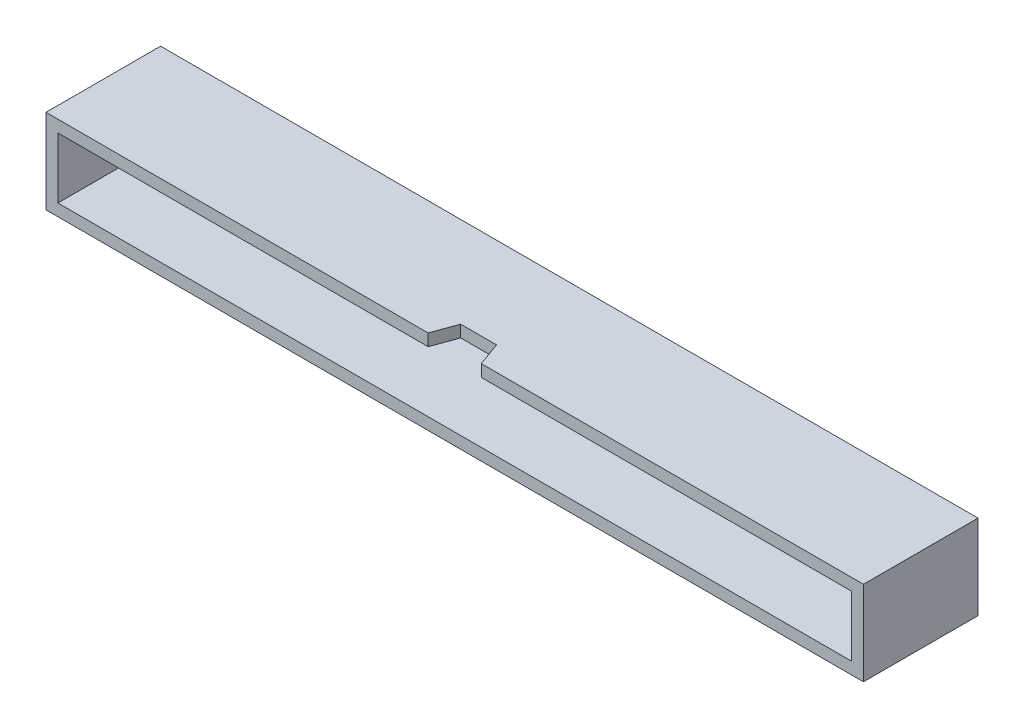
ISO-10303-21;
HEADER;
FILE_DESCRIPTION(('STEP AP214'),'2;1');
FILE_NAME('part.step','',(''),(''),'','','');
FILE_SCHEMA(('AUTOMOTIVE_DESIGN { 1 0 10303 214 1 1 1 1 }'));
ENDSEC;
DATA;
#1=APPLICATION_CONTEXT('core data for automotive mechanical design processes');
#2=APPLICATION_PROTOCOL_DEFINITION('international standard','automotive_design',2000,#1);
#3=PRODUCT_CONTEXT('',#1,'mechanical');
#4=PRODUCT('Part','Part','',(#3));
#5=PRODUCT_RELATED_PRODUCT_CATEGORY('part','',(#4));
#6=PRODUCT_DEFINITION_FORMATION('','',#4);
#7=PRODUCT_DEFINITION_CONTEXT('part definition',#1,'design');
#8=PRODUCT_DEFINITION('design','',#6,#7);
#9=PRODUCT_DEFINITION_SHAPE('','',#8);
#10=(LENGTH_UNIT() NAMED_UNIT(*) SI_UNIT(.MILLI.,.METRE.));
#11=(NAMED_UNIT(*) PLANE_ANGLE_UNIT() SI_UNIT($,.RADIAN.));
#12=(NAMED_UNIT(*) SI_UNIT($,.STERADIAN.) SOLID_ANGLE_UNIT());
#13=UNCERTAINTY_MEASURE_WITH_UNIT(LENGTH_MEASURE(1.E-05),#10,'distance_accuracy_value','');
#14=(GEOMETRIC_REPRESENTATION_CONTEXT(3) GLOBAL_UNCERTAINTY_ASSIGNED_CONTEXT((#13)) GLOBAL_UNIT_ASSIGNED_CONTEXT((#10,
#11,#12)) REPRESENTATION_CONTEXT('',''));
#15=CARTESIAN_POINT('',(0.,0.,0.));
#16=DIRECTION('',(0.,0.,1.));
#17=DIRECTION('',(1.,0.,0.));
#18=AXIS2_PLACEMENT_3D('',#15,#16,#17);
#19=CARTESIAN_POINT('',(33.48,3.54,7.60000000000002));
#20=DIRECTION('',(0.939692620785973,0.,-0.34202014332549));
#21=DIRECTION('',(-0.34202014332549,0.,-0.939692620785973));
#22=AXIS2_PLACEMENT_3D('',#19,#20,#21);
#23=PLANE('',#22);
#24=DIRECTION('',(0.,1.,0.));
#25=VECTOR('',#24,1.);
#26=CARTESIAN_POINT('',(34.207940468532,3.54,9.60000000000001));
#27=LINE('',#26,#25);
#28=CARTESIAN_POINT('',(34.207940468532,3.54,9.6));
#29=VERTEX_POINT('',#28);
#30=CARTESIAN_POINT('',(34.207940468532,2.53999998509884,9.6));
#31=VERTEX_POINT('',#30);
#32=EDGE_CURVE('E20',#29,#31,#27,.F.);
#33=ORIENTED_EDGE('',*,*,#32,.F.);
#34=DIRECTION('',(0.342020143325502,0.,0.939692620785969));
#35=VECTOR('',#34,1.);
#36=CARTESIAN_POINT('',(33.48,3.54,7.60000000000002));
#37=LINE('',#36,#35);
#38=CARTESIAN_POINT('',(33.48,3.54,7.60000000000002));
#39=VERTEX_POINT('',#38);
#40=EDGE_CURVE('E114',#39,#29,#37,.T.);
#41=ORIENTED_EDGE('',*,*,#40,.F.);
#42=DIRECTION('',(0.,1.,0.));
#43=VECTOR('',#42,1.);
#44=CARTESIAN_POINT('',(33.48,3.54,7.60000000000001));
#45=LINE('',#44,#43);
#46=CARTESIAN_POINT('',(33.48,2.53999998509884,7.60000000000002));
#47=VERTEX_POINT('',#46);
#48=EDGE_CURVE('E109',#39,#47,#45,.F.);
#49=ORIENTED_EDGE('',*,*,#48,.T.);
#50=DIRECTION('',(-0.342020143325502,0.,-0.939692620785969));
#51=VECTOR('',#50,1.);
#52=CARTESIAN_POINT('',(34.207940468532,2.53999998509884,9.6));
#53=LINE('',#52,#51);
#54=EDGE_CURVE('E111',#31,#47,#53,.T.);
#55=ORIENTED_EDGE('',*,*,#54,.F.);
#56=EDGE_LOOP('',(#33,#41,#49,#55));
#57=FACE_BOUND('',#56,.T.);
#58=ADVANCED_FACE('F17',(#57),#23,.F.);
#59=CARTESIAN_POINT('',(29.7520595314676,3.54,9.6));
#60=DIRECTION('',(-0.939692620785908,0.,-0.342020143325669));
#61=DIRECTION('',(-0.342020143325669,0.,0.939692620785908));
#62=AXIS2_PLACEMENT_3D('',#59,#60,#61);
#63=PLANE('',#62);
#64=DIRECTION('',(0.,1.,0.));
#65=VECTOR('',#64,1.);
#66=CARTESIAN_POINT('',(30.48,3.54,7.60000000000001));
#67=LINE('',#66,#65);
#68=CARTESIAN_POINT('',(30.48,2.53999998509884,7.60000000000001));
#69=VERTEX_POINT('',#68);
#70=CARTESIAN_POINT('',(30.48,3.54,7.60000000000001));
#71=VERTEX_POINT('',#70);
#72=EDGE_CURVE('E103',#69,#71,#67,.T.);
#73=ORIENTED_EDGE('',*,*,#72,.T.);
#74=DIRECTION('',(0.342020143325667,0.,-0.939692620785909));
#75=VECTOR('',#74,1.);
#76=CARTESIAN_POINT('',(29.7520595314676,3.54,9.6));
#77=LINE('',#76,#75);
#78=CARTESIAN_POINT('',(29.7520595314676,3.54,9.6));
#79=VERTEX_POINT('',#78);
#80=EDGE_CURVE('E150',#79,#71,#77,.T.);
#81=ORIENTED_EDGE('',*,*,#80,.F.);
#82=DIRECTION('',(0.,1.,0.));
#83=VECTOR('',#82,1.);
#84=CARTESIAN_POINT('',(29.7520595314676,3.54,9.6));
#85=LINE('',#84,#83);
#86=CARTESIAN_POINT('',(29.7520595314676,2.53999998509884,9.6));
#87=VERTEX_POINT('',#86);
#88=EDGE_CURVE('E136',#87,#79,#85,.T.);
#89=ORIENTED_EDGE('',*,*,#88,.F.);
#90=DIRECTION('',(-0.342020143325667,0.,0.939692620785909));
#91=VECTOR('',#90,1.);
#92=CARTESIAN_POINT('',(30.48,2.53999998509884,7.60000000000001));
#93=LINE('',#92,#91);
#94=EDGE_CURVE('E123',#69,#87,#93,.T.);
#95=ORIENTED_EDGE('',*,*,#94,.F.);
#96=EDGE_LOOP('',(#73,#81,#89,#95));
#97=FACE_BOUND('',#96,.T.);
#98=ADVANCED_FACE('F253',(#97),#63,.F.);
#99=CARTESIAN_POINT('',(30.48,3.54,7.60000000000001));
#100=DIRECTION('',(0.,0.,-1.));
#101=DIRECTION('',(-1.,0.,0.));
#102=AXIS2_PLACEMENT_3D('',#99,#100,#101);
#103=PLANE('',#102);
#104=ORIENTED_EDGE('',*,*,#48,.F.);
#105=DIRECTION('',(1.,0.,0.));
#106=VECTOR('',#105,1.);
#107=CARTESIAN_POINT('',(66.23,3.54,7.60000000000001));
#108=LINE('',#107,#106);
#109=EDGE_CURVE('E149',#71,#39,#108,.T.);
#110=ORIENTED_EDGE('',*,*,#109,.F.);
#111=ORIENTED_EDGE('',*,*,#72,.F.);
#112=DIRECTION('',(1.,0.,0.));
#113=VECTOR('',#112,1.);
#114=CARTESIAN_POINT('',(-1.26999998509884,2.53999998509884,7.60000000000002));
#115=LINE('',#114,#113);
#116=EDGE_CURVE('E119',#47,#69,#115,.F.);
#117=ORIENTED_EDGE('',*,*,#116,.F.);
#118=EDGE_LOOP('',(#104,#110,#111,#117));
#119=FACE_BOUND('',#118,.T.);
#120=ADVANCED_FACE('F120',(#119),#103,.F.);
#121=CARTESIAN_POINT('',(65.2299999850988,2.53999998509884,0.));
#122=DIRECTION('',(-1.,0.,0.));
#123=DIRECTION('',(0.,0.,1.));
#124=AXIS2_PLACEMENT_3D('',#121,#122,#123);
#125=PLANE('',#124);
#126=DIRECTION('',(0.,1.,0.));
#127=VECTOR('',#126,1.);
#128=CARTESIAN_POINT('',(65.2299999850988,0.,9.6));
#129=LINE('',#128,#127);
#130=CARTESIAN_POINT('',(65.2299999850988,2.53999998509884,9.6));
#131=VERTEX_POINT('',#130);
#132=CARTESIAN_POINT('',(65.2299999850988,-2.53999998509884,9.6));
#133=VERTEX_POINT('',#132);
#134=EDGE_CURVE('E175',#131,#133,#129,.F.);
#135=ORIENTED_EDGE('',*,*,#134,.F.);
#136=DIRECTION('',(0.,0.,-1.));
#137=VECTOR('',#136,1.);
#138=CARTESIAN_POINT('',(65.2299999850988,2.53999998509884,0.));
#139=LINE('',#138,#137);
#140=CARTESIAN_POINT('',(65.2299999850988,2.53999998509884,0.));
#141=VERTEX_POINT('',#140);
#142=EDGE_CURVE('E151',#141,#131,#139,.F.);
#143=ORIENTED_EDGE('',*,*,#142,.F.);
#144=DIRECTION('',(0.,1.,0.));
#145=VECTOR('',#144,1.);
#146=CARTESIAN_POINT('',(65.2299999850988,0.,0.));
#147=LINE('',#146,#145);
#148=CARTESIAN_POINT('',(65.2299999850988,-2.53999998509884,0.));
#149=VERTEX_POINT('',#148);
#150=EDGE_CURVE('E190',#141,#149,#147,.F.);
#151=ORIENTED_EDGE('',*,*,#150,.T.);
#152=DIRECTION('',(0.,0.,1.));
#153=VECTOR('',#152,1.);
#154=CARTESIAN_POINT('',(65.2299999850988,-2.53999998509884,0.));
#155=LINE('',#154,#153);
#156=EDGE_CURVE('E116',#133,#149,#155,.F.);
#157=ORIENTED_EDGE('',*,*,#156,.F.);
#158=EDGE_LOOP('',(#135,#143,#151,#157));
#159=FACE_BOUND('',#158,.T.);
#160=ADVANCED_FACE('F247',(#159),#125,.T.);
#161=CARTESIAN_POINT('',(65.2299999850988,-2.53999998509884,0.));
#162=DIRECTION('',(0.,1.,0.));
#163=DIRECTION('',(0.,0.,1.));
#164=AXIS2_PLACEMENT_3D('',#161,#162,#163);
#165=PLANE('',#164);
#166=DIRECTION('',(1.,0.,0.));
#167=VECTOR('',#166,1.);
#168=CARTESIAN_POINT('',(31.98,-2.53999998509884,9.6));
#169=LINE('',#168,#167);
#170=CARTESIAN_POINT('',(-1.26999998509884,-2.53999998509884,9.6));
#171=VERTEX_POINT('',#170);
#172=EDGE_CURVE('E170',#133,#171,#169,.F.);
#173=ORIENTED_EDGE('',*,*,#172,.F.);
#174=ORIENTED_EDGE('',*,*,#156,.T.);
#175=DIRECTION('',(1.,0.,0.));
#176=VECTOR('',#175,1.);
#177=CARTESIAN_POINT('',(31.98,-2.53999998509884,0.));
#178=LINE('',#177,#176);
#179=CARTESIAN_POINT('',(-1.26999998509884,-2.53999998509884,0.));
#180=VERTEX_POINT('',#179);
#181=EDGE_CURVE('E188',#149,#180,#178,.F.);
#182=ORIENTED_EDGE('',*,*,#181,.T.);
#183=DIRECTION('',(0.,0.,1.));
#184=VECTOR('',#183,1.);
#185=CARTESIAN_POINT('',(-1.26999998509884,-2.53999998509884,0.));
#186=LINE('',#185,#184);
#187=EDGE_CURVE('E128',#171,#180,#186,.F.);
#188=ORIENTED_EDGE('',*,*,#187,.F.);
#189=EDGE_LOOP('',(#173,#174,#182,#188));
#190=FACE_BOUND('',#189,.T.);
#191=ADVANCED_FACE('F243',(#190),#165,.T.);
#192=CARTESIAN_POINT('',(-1.26999998509884,-2.53999998509884,0.));
#193=DIRECTION('',(1.,0.,0.));
#194=DIRECTION('',(0.,1.,0.));
#195=AXIS2_PLACEMENT_3D('',#192,#193,#194);
#196=PLANE('',#195);
#197=DIRECTION('',(0.,1.,0.));
#198=VECTOR('',#197,1.);
#199=CARTESIAN_POINT('',(-1.26999998509884,0.,9.6));
#200=LINE('',#199,#198);
#201=CARTESIAN_POINT('',(-1.26999998509884,2.53999998509884,9.6));
#202=VERTEX_POINT('',#201);
#203=EDGE_CURVE('E165',#171,#202,#200,.T.);
#204=ORIENTED_EDGE('',*,*,#203,.F.);
#205=ORIENTED_EDGE('',*,*,#187,.T.);
#206=DIRECTION('',(0.,1.,0.));
#207=VECTOR('',#206,1.);
#208=CARTESIAN_POINT('',(-1.26999998509884,0.,0.));
#209=LINE('',#208,#207);
#210=CARTESIAN_POINT('',(-1.26999998509884,2.53999998509884,0.));
#211=VERTEX_POINT('',#210);
#212=EDGE_CURVE('E186',#180,#211,#209,.T.);
#213=ORIENTED_EDGE('',*,*,#212,.T.);
#214=DIRECTION('',(0.,0.,-1.));
#215=VECTOR('',#214,1.);
#216=CARTESIAN_POINT('',(-1.26999998509884,2.53999998509884,0.));
#217=LINE('',#216,#215);
#218=EDGE_CURVE('E154',#202,#211,#217,.T.);
#219=ORIENTED_EDGE('',*,*,#218,.F.);
#220=EDGE_LOOP('',(#204,#205,#213,#219));
#221=FACE_BOUND('',#220,.T.);
#222=ADVANCED_FACE('F240',(#221),#196,.T.);
#223=CARTESIAN_POINT('',(-1.26999998509884,2.53999998509884,0.));
#224=DIRECTION('',(0.,-1.,0.));
#225=DIRECTION('',(0.,0.,-1.));
#226=AXIS2_PLACEMENT_3D('',#223,#224,#225);
#227=PLANE('',#226);
#228=ORIENTED_EDGE('',*,*,#142,.T.);
#229=DIRECTION('',(1.,0.,0.));
#230=VECTOR('',#229,1.);
#231=CARTESIAN_POINT('',(31.98,2.53999998509884,9.6));
#232=LINE('',#231,#230);
#233=EDGE_CURVE('E127',#31,#131,#232,.T.);
#234=ORIENTED_EDGE('',*,*,#233,.F.);
#235=ORIENTED_EDGE('',*,*,#54,.T.);
#236=ORIENTED_EDGE('',*,*,#116,.T.);
#237=ORIENTED_EDGE('',*,*,#94,.T.);
#238=DIRECTION('',(1.,0.,0.));
#239=VECTOR('',#238,1.);
#240=CARTESIAN_POINT('',(31.98,2.53999998509884,9.6));
#241=LINE('',#240,#239);
#242=EDGE_CURVE('E160',#202,#87,#241,.T.);
#243=ORIENTED_EDGE('',*,*,#242,.F.);
#244=ORIENTED_EDGE('',*,*,#218,.T.);
#245=DIRECTION('',(1.,0.,0.));
#246=VECTOR('',#245,1.);
#247=CARTESIAN_POINT('',(31.98,2.53999998509884,0.));
#248=LINE('',#247,#246);
#249=EDGE_CURVE('E183',#211,#141,#248,.T.);
#250=ORIENTED_EDGE('',*,*,#249,.T.);
#251=EDGE_LOOP('',(#228,#234,#235,#236,#237,#243,#244,#250));
#252=FACE_BOUND('',#251,.T.);
#253=ADVANCED_FACE('F125',(#252),#227,.T.);
#254=CARTESIAN_POINT('',(66.23,3.54,0.));
#255=DIRECTION('',(0.,1.,0.));
#256=DIRECTION('',(0.,0.,1.));
#257=AXIS2_PLACEMENT_3D('',#254,#255,#256);
#258=PLANE('',#257);
#259=ORIENTED_EDGE('',*,*,#80,.T.);
#260=ORIENTED_EDGE('',*,*,#109,.T.);
#261=ORIENTED_EDGE('',*,*,#40,.T.);
#262=DIRECTION('',(1.,0.,0.));
#263=VECTOR('',#262,1.);
#264=CARTESIAN_POINT('',(31.98,3.54,9.6));
#265=LINE('',#264,#263);
#266=CARTESIAN_POINT('',(66.23,3.54,9.6));
#267=VERTEX_POINT('',#266);
#268=EDGE_CURVE('E144',#267,#29,#265,.F.);
#269=ORIENTED_EDGE('',*,*,#268,.F.);
#270=DIRECTION('',(0.,0.,-1.));
#271=VECTOR('',#270,1.);
#272=CARTESIAN_POINT('',(66.23,3.54,0.));
#273=LINE('',#272,#271);
#274=CARTESIAN_POINT('',(66.23,3.54,0.));
#275=VERTEX_POINT('',#274);
#276=EDGE_CURVE('E178',#275,#267,#273,.F.);
#277=ORIENTED_EDGE('',*,*,#276,.F.);
#278=DIRECTION('',(1.,0.,0.));
#279=VECTOR('',#278,1.);
#280=CARTESIAN_POINT('',(31.98,3.54,0.));
#281=LINE('',#280,#279);
#282=CARTESIAN_POINT('',(-2.27,3.54,0.));
#283=VERTEX_POINT('',#282);
#284=EDGE_CURVE('E192',#275,#283,#281,.F.);
#285=ORIENTED_EDGE('',*,*,#284,.T.);
#286=DIRECTION('',(0.,0.,1.));
#287=VECTOR('',#286,1.);
#288=CARTESIAN_POINT('',(-2.27,3.54,0.));
#289=LINE('',#288,#287);
#290=CARTESIAN_POINT('',(-2.27,3.54,9.6));
#291=VERTEX_POINT('',#290);
#292=EDGE_CURVE('E197',#291,#283,#289,.F.);
#293=ORIENTED_EDGE('',*,*,#292,.F.);
#294=DIRECTION('',(1.,0.,0.));
#295=VECTOR('',#294,1.);
#296=CARTESIAN_POINT('',(31.98,3.54,9.6));
#297=LINE('',#296,#295);
#298=EDGE_CURVE('E166',#79,#291,#297,.F.);
#299=ORIENTED_EDGE('',*,*,#298,.F.);
#300=EDGE_LOOP('',(#259,#260,#261,#269,#277,#285,#293,#299));
#301=FACE_BOUND('',#300,.T.);
#302=ADVANCED_FACE('F147',(#301),#258,.T.);
#303=CARTESIAN_POINT('',(31.98,0.,0.));
#304=DIRECTION('',(0.,0.,1.));
#305=DIRECTION('',(1.,0.,0.));
#306=AXIS2_PLACEMENT_3D('',#303,#304,#305);
#307=PLANE('',#306);
#308=ORIENTED_EDGE('',*,*,#212,.F.);
#309=ORIENTED_EDGE('',*,*,#181,.F.);
#310=ORIENTED_EDGE('',*,*,#150,.F.);
#311=ORIENTED_EDGE('',*,*,#249,.F.);
#312=EDGE_LOOP('',(#308,#309,#310,#311));
#313=FACE_BOUND('',#312,.T.);
#314=DIRECTION('',(0.,1.,0.));
#315=VECTOR('',#314,1.);
#316=CARTESIAN_POINT('',(-2.27,3.54,0.));
#317=LINE('',#316,#315);
#318=CARTESIAN_POINT('',(-2.27,-3.54,0.));
#319=VERTEX_POINT('',#318);
#320=EDGE_CURVE('E200',#283,#319,#317,.F.);
#321=ORIENTED_EDGE('',*,*,#320,.F.);
#322=ORIENTED_EDGE('',*,*,#284,.F.);
#323=DIRECTION('',(0.,1.,0.));
#324=VECTOR('',#323,1.);
#325=CARTESIAN_POINT('',(66.23,-3.54,0.));
#326=LINE('',#325,#324);
#327=CARTESIAN_POINT('',(66.23,-3.54,0.));
#328=VERTEX_POINT('',#327);
#329=EDGE_CURVE('E180',#328,#275,#326,.T.);
#330=ORIENTED_EDGE('',*,*,#329,.F.);
#331=DIRECTION('',(1.,0.,0.));
#332=VECTOR('',#331,1.);
#333=CARTESIAN_POINT('',(-2.27,-3.54,0.));
#334=LINE('',#333,#332);
#335=EDGE_CURVE('E203',#319,#328,#334,.T.);
#336=ORIENTED_EDGE('',*,*,#335,.F.);
#337=EDGE_LOOP('',(#321,#322,#330,#336));
#338=FACE_BOUND('',#337,.T.);
#339=ADVANCED_FACE('F201',(#313,#338),#307,.F.);
#340=CARTESIAN_POINT('',(66.23,-3.54,0.));
#341=DIRECTION('',(1.,0.,0.));
#342=DIRECTION('',(0.,0.,-1.));
#343=AXIS2_PLACEMENT_3D('',#340,#341,#342);
#344=PLANE('',#343);
#345=DIRECTION('',(0.,1.,0.));
#346=VECTOR('',#345,1.);
#347=CARTESIAN_POINT('',(66.23,0.,9.6));
#348=LINE('',#347,#346);
#349=CARTESIAN_POINT('',(66.23,-3.54,9.6));
#350=VERTEX_POINT('',#349);
#351=EDGE_CURVE('E168',#350,#267,#348,.T.);
#352=ORIENTED_EDGE('',*,*,#351,.F.);
#353=DIRECTION('',(0.,0.,-1.));
#354=VECTOR('',#353,1.);
#355=CARTESIAN_POINT('',(66.23,-3.54,0.));
#356=LINE('',#355,#354);
#357=EDGE_CURVE('E208',#328,#350,#356,.F.);
#358=ORIENTED_EDGE('',*,*,#357,.F.);
#359=ORIENTED_EDGE('',*,*,#329,.T.);
#360=ORIENTED_EDGE('',*,*,#276,.T.);
#361=EDGE_LOOP('',(#352,#358,#359,#360));
#362=FACE_BOUND('',#361,.T.);
#363=ADVANCED_FACE('F217',(#362),#344,.T.);
#364=CARTESIAN_POINT('',(31.98,0.,9.6));
#365=DIRECTION('',(0.,0.,1.));
#366=DIRECTION('',(1.,0.,0.));
#367=AXIS2_PLACEMENT_3D('',#364,#365,#366);
#368=PLANE('',#367);
#369=ORIENTED_EDGE('',*,*,#351,.T.);
#370=ORIENTED_EDGE('',*,*,#268,.T.);
#371=ORIENTED_EDGE('',*,*,#32,.T.);
#372=ORIENTED_EDGE('',*,*,#233,.T.);
#373=ORIENTED_EDGE('',*,*,#134,.T.);
#374=ORIENTED_EDGE('',*,*,#172,.T.);
#375=ORIENTED_EDGE('',*,*,#203,.T.);
#376=ORIENTED_EDGE('',*,*,#242,.T.);
#377=ORIENTED_EDGE('',*,*,#88,.T.);
#378=ORIENTED_EDGE('',*,*,#298,.T.);
#379=DIRECTION('',(0.,1.,0.));
#380=VECTOR('',#379,1.);
#381=CARTESIAN_POINT('',(-2.27,3.54,9.6));
#382=LINE('',#381,#380);
#383=CARTESIAN_POINT('',(-2.27,-3.54,9.6));
#384=VERTEX_POINT('',#383);
#385=EDGE_CURVE('E35',#384,#291,#382,.T.);
#386=ORIENTED_EDGE('',*,*,#385,.F.);
#387=DIRECTION('',(1.,0.,0.));
#388=VECTOR('',#387,1.);
#389=CARTESIAN_POINT('',(-2.27,-3.54,9.6));
#390=LINE('',#389,#388);
#391=EDGE_CURVE('E26',#350,#384,#390,.F.);
#392=ORIENTED_EDGE('',*,*,#391,.F.);
#393=EDGE_LOOP('',(#369,#370,#371,#372,#373,#374,#375,#376,#377,#378,#386,#392));
#394=FACE_BOUND('',#393,.T.);
#395=ADVANCED_FACE('F141',(#394),#368,.T.);
#396=CARTESIAN_POINT('',(-2.27,3.54,0.));
#397=DIRECTION('',(-1.,0.,0.));
#398=DIRECTION('',(0.,0.,1.));
#399=AXIS2_PLACEMENT_3D('',#396,#397,#398);
#400=PLANE('',#399);
#401=ORIENTED_EDGE('',*,*,#385,.T.);
#402=ORIENTED_EDGE('',*,*,#292,.T.);
#403=ORIENTED_EDGE('',*,*,#320,.T.);
#404=DIRECTION('',(0.,0.,-1.));
#405=VECTOR('',#404,1.);
#406=CARTESIAN_POINT('',(-2.27,-3.54,0.));
#407=LINE('',#406,#405);
#408=EDGE_CURVE('E11',#384,#319,#407,.T.);
#409=ORIENTED_EDGE('',*,*,#408,.F.);
#410=EDGE_LOOP('',(#401,#402,#403,#409));
#411=FACE_BOUND('',#410,.T.);
#412=ADVANCED_FACE('F206',(#411),#400,.T.);
#413=CARTESIAN_POINT('',(-2.27,-3.54,0.));
#414=DIRECTION('',(0.,-1.,0.));
#415=DIRECTION('',(0.,0.,-1.));
#416=AXIS2_PLACEMENT_3D('',#413,#414,#415);
#417=PLANE('',#416);
#418=ORIENTED_EDGE('',*,*,#391,.T.);
#419=ORIENTED_EDGE('',*,*,#408,.T.);
#420=ORIENTED_EDGE('',*,*,#335,.T.);
#421=ORIENTED_EDGE('',*,*,#357,.T.);
#422=EDGE_LOOP('',(#418,#419,#420,#421));
#423=FACE_BOUND('',#422,.T.);
#424=ADVANCED_FACE('F219',(#423),#417,.T.);
#425=CLOSED_SHELL('',(#58,#98,#120,#160,#191,#222,#253,#302,#339,#363,#395,#412,#424));
#426=MANIFOLD_SOLID_BREP('B1',#425);
#427=ADVANCED_BREP_SHAPE_REPRESENTATION('',(#18,#426),#14);
#428=SHAPE_DEFINITION_REPRESENTATION(#9,#427);
ENDSEC;
END-ISO-10303-21;
